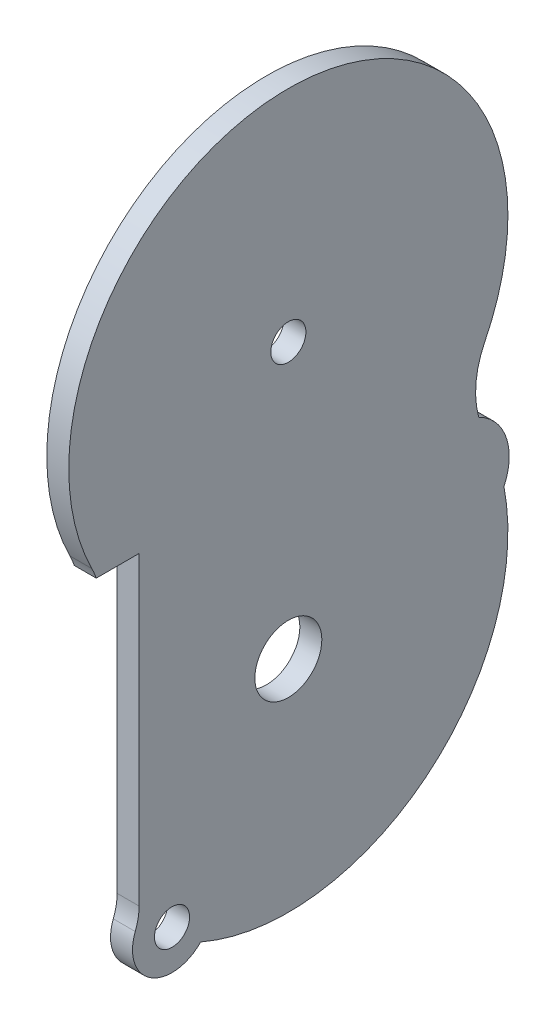
ISO-10303-21;
HEADER;
FILE_DESCRIPTION(('STEP AP214'),'2;1');
FILE_NAME('part.step','',(''),(''),'','','');
FILE_SCHEMA(('AUTOMOTIVE_DESIGN { 1 0 10303 214 1 1 1 1 }'));
ENDSEC;
DATA;
#1=APPLICATION_CONTEXT('core data for automotive mechanical design processes');
#2=APPLICATION_PROTOCOL_DEFINITION('international standard','automotive_design',2000,#1);
#3=PRODUCT_CONTEXT('',#1,'mechanical');
#4=PRODUCT('Part','Part','',(#3));
#5=PRODUCT_RELATED_PRODUCT_CATEGORY('part','',(#4));
#6=PRODUCT_DEFINITION_FORMATION('','',#4);
#7=PRODUCT_DEFINITION_CONTEXT('part definition',#1,'design');
#8=PRODUCT_DEFINITION('design','',#6,#7);
#9=PRODUCT_DEFINITION_SHAPE('','',#8);
#10=(LENGTH_UNIT() NAMED_UNIT(*) SI_UNIT(.MILLI.,.METRE.));
#11=(NAMED_UNIT(*) PLANE_ANGLE_UNIT() SI_UNIT($,.RADIAN.));
#12=(NAMED_UNIT(*) SI_UNIT($,.STERADIAN.) SOLID_ANGLE_UNIT());
#13=UNCERTAINTY_MEASURE_WITH_UNIT(LENGTH_MEASURE(1.E-05),#10,'distance_accuracy_value','');
#14=(GEOMETRIC_REPRESENTATION_CONTEXT(3) GLOBAL_UNCERTAINTY_ASSIGNED_CONTEXT((#13)) GLOBAL_UNIT_ASSIGNED_CONTEXT((#10,
#11,#12)) REPRESENTATION_CONTEXT('',''));
#15=CARTESIAN_POINT('',(0.,0.,0.));
#16=DIRECTION('',(0.,0.,1.));
#17=DIRECTION('',(1.,0.,0.));
#18=AXIS2_PLACEMENT_3D('',#15,#16,#17);
#19=CARTESIAN_POINT('',(-2.93378069120176,0.,-8.31641879275313));
#20=DIRECTION('',(0.,0.,-1.));
#21=DIRECTION('',(-1.,0.,0.));
#22=AXIS2_PLACEMENT_3D('',#19,#20,#21);
#23=PLANE('',#22);
#24=DIRECTION('',(0.,-1.,0.));
#25=VECTOR('',#24,1.);
#26=CARTESIAN_POINT('',(-4.93378069120176,0.,-8.31641879275313));
#27=LINE('',#26,#25);
#28=CARTESIAN_POINT('',(-4.93378069120176,-3.5830057275672,-8.31641879275313));
#29=VERTEX_POINT('',#28);
#30=CARTESIAN_POINT('',(-4.93378069120176,-31.3949801182929,-8.31641879275317));
#31=VERTEX_POINT('',#30);
#32=EDGE_CURVE('E154',#29,#31,#27,.T.);
#33=ORIENTED_EDGE('',*,*,#32,.T.);
#34=DIRECTION('',(-1.,0.,0.));
#35=VECTOR('',#34,1.);
#36=CARTESIAN_POINT('',(-2.93378069120176,-31.3949801182929,-8.31641879275317));
#37=LINE('',#36,#35);
#38=CARTESIAN_POINT('',(-2.93378069120176,-31.3949801182929,-8.31641879275317));
#39=VERTEX_POINT('',#38);
#40=EDGE_CURVE('E11',#39,#31,#37,.T.);
#41=ORIENTED_EDGE('',*,*,#40,.F.);
#42=DIRECTION('',(0.,-1.,0.));
#43=VECTOR('',#42,1.);
#44=CARTESIAN_POINT('',(-2.93378069120176,0.,-8.31641879275313));
#45=LINE('',#44,#43);
#46=CARTESIAN_POINT('',(-2.93378069120176,-3.5830057275672,-8.31641879275313));
#47=VERTEX_POINT('',#46);
#48=EDGE_CURVE('E217',#47,#39,#45,.T.);
#49=ORIENTED_EDGE('',*,*,#48,.F.);
#50=DIRECTION('',(-1.,0.,0.));
#51=VECTOR('',#50,1.);
#52=CARTESIAN_POINT('',(-2.93378069120176,-3.5830057275672,-8.31641879275313));
#53=LINE('',#52,#51);
#54=EDGE_CURVE('E150',#47,#29,#53,.T.);
#55=ORIENTED_EDGE('',*,*,#54,.T.);
#56=EDGE_LOOP('',(#33,#41,#49,#55));
#57=FACE_BOUND('',#56,.T.);
#58=ADVANCED_FACE('F41',(#57),#23,.F.);
#59=CARTESIAN_POINT('',(-2.93378069120176,-31.3949801182929,-3.31641879275324));
#60=DIRECTION('',(-1.,0.,0.));
#61=DIRECTION('',(0.,0.,1.));
#62=AXIS2_PLACEMENT_3D('',#59,#60,#61);
#63=CYLINDRICAL_SURFACE('',#62,4.99999999999993);
#64=CARTESIAN_POINT('',(-4.93378069120176,-31.3949801182929,-3.31641879275324));
#65=DIRECTION('',(1.,0.,0.));
#66=DIRECTION('',(0.,0.,-1.));
#67=AXIS2_PLACEMENT_3D('',#64,#65,#66);
#68=CIRCLE('',#67,4.99999999999993);
#69=CARTESIAN_POINT('',(-4.93378069120176,-33.22983289016,-7.9675815834509));
#70=VERTEX_POINT('',#69);
#71=EDGE_CURVE('E157',#31,#70,#68,.F.);
#72=ORIENTED_EDGE('',*,*,#71,.T.);
#73=DIRECTION('',(-1.,0.,0.));
#74=VECTOR('',#73,1.);
#75=CARTESIAN_POINT('',(-2.93378069120176,-33.22983289016,-7.9675815834509));
#76=LINE('',#75,#74);
#77=CARTESIAN_POINT('',(-2.93378069120176,-33.22983289016,-7.9675815834509));
#78=VERTEX_POINT('',#77);
#79=EDGE_CURVE('E50',#78,#70,#76,.T.);
#80=ORIENTED_EDGE('',*,*,#79,.F.);
#81=CARTESIAN_POINT('',(-2.93378069120176,-31.3949801182929,-3.31641879275324));
#82=DIRECTION('',(1.,0.,0.));
#83=DIRECTION('',(0.,0.,-1.));
#84=AXIS2_PLACEMENT_3D('',#81,#82,#83);
#85=CIRCLE('',#84,4.99999999999993);
#86=EDGE_CURVE('E104',#39,#78,#85,.F.);
#87=ORIENTED_EDGE('',*,*,#86,.F.);
#88=ORIENTED_EDGE('',*,*,#40,.T.);
#89=EDGE_LOOP('',(#72,#80,#87,#88));
#90=FACE_BOUND('',#89,.T.);
#91=ADVANCED_FACE('F236',(#90),#63,.F.);
#92=CARTESIAN_POINT('',(-2.93378069120176,-34.5509268859048,-11.3164187927532));
#93=DIRECTION('',(-1.,0.,0.));
#94=DIRECTION('',(0.,0.,1.));
#95=AXIS2_PLACEMENT_3D('',#92,#93,#94);
#96=CYLINDRICAL_SURFACE('',#95,3.6000000000001);
#97=CARTESIAN_POINT('',(-4.93378069120176,-34.5509268859048,-11.3164187927532));
#98=DIRECTION('',(1.,0.,0.));
#99=DIRECTION('',(0.,0.,-1.));
#100=AXIS2_PLACEMENT_3D('',#97,#98,#99);
#101=CIRCLE('',#100,3.6000000000001);
#102=CARTESIAN_POINT('',(-4.93378069120176,-37.0335515650304,-13.9234429013103));
#103=VERTEX_POINT('',#102);
#104=EDGE_CURVE('E159',#70,#103,#101,.T.);
#105=ORIENTED_EDGE('',*,*,#104,.T.);
#106=DIRECTION('',(-1.,0.,0.));
#107=VECTOR('',#106,1.);
#108=CARTESIAN_POINT('',(-2.93378069120176,-37.0335515650304,-13.9234429013103));
#109=LINE('',#108,#107);
#110=CARTESIAN_POINT('',(-2.93378069120176,-37.0335515650304,-13.9234429013103));
#111=VERTEX_POINT('',#110);
#112=EDGE_CURVE('E186',#111,#103,#109,.T.);
#113=ORIENTED_EDGE('',*,*,#112,.F.);
#114=CARTESIAN_POINT('',(-2.93378069120176,-34.5509268859048,-11.3164187927532));
#115=DIRECTION('',(1.,0.,0.));
#116=DIRECTION('',(0.,0.,-1.));
#117=AXIS2_PLACEMENT_3D('',#114,#115,#116);
#118=CIRCLE('',#117,3.6000000000001);
#119=EDGE_CURVE('E194',#78,#111,#118,.T.);
#120=ORIENTED_EDGE('',*,*,#119,.F.);
#121=ORIENTED_EDGE('',*,*,#79,.T.);
#122=EDGE_LOOP('',(#105,#113,#120,#121));
#123=FACE_BOUND('',#122,.T.);
#124=ADVANCED_FACE('F192',(#123),#96,.T.);
#125=CARTESIAN_POINT('',(-2.93378069120176,-18.698005727567,-21.9114187927536));
#126=DIRECTION('',(-1.,0.,0.));
#127=DIRECTION('',(0.,0.,1.));
#128=AXIS2_PLACEMENT_3D('',#125,#126,#127);
#129=CYLINDRICAL_SURFACE('',#128,20.);
#130=CARTESIAN_POINT('',(-4.93378069120176,-18.698005727567,-21.9114187927536));
#131=DIRECTION('',(1.,0.,0.));
#132=DIRECTION('',(0.,0.,-1.));
#133=AXIS2_PLACEMENT_3D('',#130,#131,#132);
#134=CIRCLE('',#133,20.);
#135=CARTESIAN_POINT('',(-4.93378069120176,-14.9205868842048,-41.5514571552878));
#136=VERTEX_POINT('',#135);
#137=EDGE_CURVE('E161',#103,#136,#134,.T.);
#138=ORIENTED_EDGE('',*,*,#137,.T.);
#139=DIRECTION('',(-1.,0.,0.));
#140=VECTOR('',#139,1.);
#141=CARTESIAN_POINT('',(-2.93378069120176,-14.9205868842048,-41.5514571552878));
#142=LINE('',#141,#140);
#143=CARTESIAN_POINT('',(-2.93378069120176,-14.9205868842048,-41.5514571552878));
#144=VERTEX_POINT('',#143);
#145=EDGE_CURVE('E183',#144,#136,#142,.T.);
#146=ORIENTED_EDGE('',*,*,#145,.F.);
#147=CARTESIAN_POINT('',(-2.93378069120176,-18.698005727567,-21.9114187927536));
#148=DIRECTION('',(1.,0.,0.));
#149=DIRECTION('',(0.,0.,-1.));
#150=AXIS2_PLACEMENT_3D('',#147,#148,#149);
#151=CIRCLE('',#150,20.);
#152=EDGE_CURVE('E211',#111,#144,#151,.T.);
#153=ORIENTED_EDGE('',*,*,#152,.F.);
#154=ORIENTED_EDGE('',*,*,#112,.T.);
#155=EDGE_LOOP('',(#138,#146,#153,#154));
#156=FACE_BOUND('',#155,.T.);
#157=ADVANCED_FACE('F204',(#156),#129,.T.);
#158=CARTESIAN_POINT('',(-2.93378069120176,-12.7830057275671,-37.0314187927532));
#159=DIRECTION('',(-1.,0.,0.));
#160=DIRECTION('',(0.,0.,1.));
#161=AXIS2_PLACEMENT_3D('',#158,#159,#160);
#162=CYLINDRICAL_SURFACE('',#161,4.99999999999971);
#163=CARTESIAN_POINT('',(-4.93378069120176,-12.7830057275671,-37.0314187927532));
#164=DIRECTION('',(1.,0.,0.));
#165=DIRECTION('',(0.,0.,-1.));
#166=AXIS2_PLACEMENT_3D('',#163,#164,#165);
#167=CIRCLE('',#166,4.99999999999971);
#168=CARTESIAN_POINT('',(-4.93378069120176,-8.30104590636624,-39.2477301790738));
#169=VERTEX_POINT('',#168);
#170=EDGE_CURVE('E163',#136,#169,#167,.T.);
#171=ORIENTED_EDGE('',*,*,#170,.T.);
#172=DIRECTION('',(-1.,0.,0.));
#173=VECTOR('',#172,1.);
#174=CARTESIAN_POINT('',(-2.93378069120176,-8.30104590636624,-39.2477301790738));
#175=LINE('',#174,#173);
#176=CARTESIAN_POINT('',(-2.93378069120176,-8.30104590636624,-39.2477301790738));
#177=VERTEX_POINT('',#176);
#178=EDGE_CURVE('E180',#177,#169,#175,.T.);
#179=ORIENTED_EDGE('',*,*,#178,.F.);
#180=CARTESIAN_POINT('',(-2.93378069120176,-12.7830057275671,-37.0314187927532));
#181=DIRECTION('',(1.,0.,0.));
#182=DIRECTION('',(0.,0.,-1.));
#183=AXIS2_PLACEMENT_3D('',#180,#181,#182);
#184=CIRCLE('',#183,4.99999999999971);
#185=EDGE_CURVE('E210',#144,#177,#184,.T.);
#186=ORIENTED_EDGE('',*,*,#185,.F.);
#187=ORIENTED_EDGE('',*,*,#145,.T.);
#188=EDGE_LOOP('',(#171,#179,#186,#187));
#189=FACE_BOUND('',#188,.T.);
#190=ADVANCED_FACE('F208',(#189),#162,.T.);
#191=CARTESIAN_POINT('',(-2.93378069120176,-6.19800572756679,-46.9663584254887));
#192=DIRECTION('',(-1.,0.,0.));
#193=DIRECTION('',(0.,0.,1.));
#194=AXIS2_PLACEMENT_3D('',#191,#192,#193);
#195=CYLINDRICAL_SURFACE('',#194,7.9999999999999);
#196=CARTESIAN_POINT('',(-4.93378069120176,-6.19800572756679,-46.9663584254887));
#197=DIRECTION('',(1.,0.,0.));
#198=DIRECTION('',(0.,0.,-1.));
#199=AXIS2_PLACEMENT_3D('',#196,#197,#198);
#200=CIRCLE('',#199,7.9999999999999);
#201=CARTESIAN_POINT('',(-4.93378069120176,-2.62657715613827,-39.8078042447071));
#202=VERTEX_POINT('',#201);
#203=EDGE_CURVE('E165',#169,#202,#200,.F.);
#204=ORIENTED_EDGE('',*,*,#203,.T.);
#205=DIRECTION('',(-1.,0.,0.));
#206=VECTOR('',#205,1.);
#207=CARTESIAN_POINT('',(-2.93378069120176,-2.62657715613827,-39.8078042447071));
#208=LINE('',#207,#206);
#209=CARTESIAN_POINT('',(-2.93378069120176,-2.62657715613827,-39.8078042447071));
#210=VERTEX_POINT('',#209);
#211=EDGE_CURVE('E136',#210,#202,#208,.T.);
#212=ORIENTED_EDGE('',*,*,#211,.F.);
#213=CARTESIAN_POINT('',(-2.93378069120176,-6.19800572756679,-46.9663584254887));
#214=DIRECTION('',(1.,0.,0.));
#215=DIRECTION('',(0.,0.,-1.));
#216=AXIS2_PLACEMENT_3D('',#213,#214,#215);
#217=CIRCLE('',#216,7.9999999999999);
#218=EDGE_CURVE('E127',#177,#210,#217,.F.);
#219=ORIENTED_EDGE('',*,*,#218,.F.);
#220=ORIENTED_EDGE('',*,*,#178,.T.);
#221=EDGE_LOOP('',(#204,#212,#219,#220));
#222=FACE_BOUND('',#221,.T.);
#223=ADVANCED_FACE('F249',(#222),#195,.F.);
#224=CARTESIAN_POINT('',(-2.93378069120176,6.30199427243294,-21.9114187927536));
#225=DIRECTION('',(-1.,0.,0.));
#226=DIRECTION('',(0.,0.,1.));
#227=AXIS2_PLACEMENT_3D('',#224,#225,#226);
#228=CYLINDRICAL_SURFACE('',#227,19.9999999999997);
#229=CARTESIAN_POINT('',(-4.93378069120176,6.30199427243294,-21.9114187927536));
#230=DIRECTION('',(1.,0.,0.));
#231=DIRECTION('',(0.,0.,-1.));
#232=AXIS2_PLACEMENT_3D('',#229,#230,#231);
#233=CIRCLE('',#232,19.9999999999997);
#234=CARTESIAN_POINT('',(-4.93378069120176,-2.62657715613863,-4.01503334080031));
#235=VERTEX_POINT('',#234);
#236=EDGE_CURVE('E135',#202,#235,#233,.T.);
#237=ORIENTED_EDGE('',*,*,#236,.T.);
#238=DIRECTION('',(-1.,0.,0.));
#239=VECTOR('',#238,1.);
#240=CARTESIAN_POINT('',(-2.93378069120176,-2.62657715613863,-4.01503334080031));
#241=LINE('',#240,#239);
#242=CARTESIAN_POINT('',(-2.93378069120176,-2.62657715613863,-4.01503334080031));
#243=VERTEX_POINT('',#242);
#244=EDGE_CURVE('E132',#243,#235,#241,.T.);
#245=ORIENTED_EDGE('',*,*,#244,.F.);
#246=CARTESIAN_POINT('',(-2.93378069120176,6.30199427243294,-21.9114187927536));
#247=DIRECTION('',(1.,0.,0.));
#248=DIRECTION('',(0.,0.,-1.));
#249=AXIS2_PLACEMENT_3D('',#246,#247,#248);
#250=CIRCLE('',#249,19.9999999999997);
#251=EDGE_CURVE('E120',#210,#243,#250,.T.);
#252=ORIENTED_EDGE('',*,*,#251,.F.);
#253=ORIENTED_EDGE('',*,*,#211,.T.);
#254=EDGE_LOOP('',(#237,#245,#252,#253));
#255=FACE_BOUND('',#254,.T.);
#256=ADVANCED_FACE('F133',(#255),#228,.T.);
#257=CARTESIAN_POINT('',(-2.93378069120176,-6.19800572756679,3.14352083998148));
#258=DIRECTION('',(-1.,0.,0.));
#259=DIRECTION('',(0.,0.,1.));
#260=AXIS2_PLACEMENT_3D('',#257,#258,#259);
#261=CYLINDRICAL_SURFACE('',#260,8.00000000000012);
#262=CARTESIAN_POINT('',(-4.93378069120176,-6.19800572756679,3.14352083998148));
#263=DIRECTION('',(1.,0.,0.));
#264=DIRECTION('',(0.,0.,-1.));
#265=AXIS2_PLACEMENT_3D('',#262,#263,#264);
#266=CIRCLE('',#265,8.00000000000012);
#267=CARTESIAN_POINT('',(-4.93378069120176,-3.5830057275672,-4.41701981528908));
#268=VERTEX_POINT('',#267);
#269=EDGE_CURVE('E90',#235,#268,#266,.F.);
#270=ORIENTED_EDGE('',*,*,#269,.T.);
#271=DIRECTION('',(-1.,0.,0.));
#272=VECTOR('',#271,1.);
#273=CARTESIAN_POINT('',(-2.93378069120176,-3.5830057275672,-4.41701981528908));
#274=LINE('',#273,#272);
#275=CARTESIAN_POINT('',(-2.93378069120176,-3.5830057275672,-4.41701981528908));
#276=VERTEX_POINT('',#275);
#277=EDGE_CURVE('E137',#276,#268,#274,.T.);
#278=ORIENTED_EDGE('',*,*,#277,.F.);
#279=CARTESIAN_POINT('',(-2.93378069120176,-6.19800572756679,3.14352083998148));
#280=DIRECTION('',(1.,0.,0.));
#281=DIRECTION('',(0.,0.,-1.));
#282=AXIS2_PLACEMENT_3D('',#279,#280,#281);
#283=CIRCLE('',#282,8.00000000000012);
#284=EDGE_CURVE('E125',#243,#276,#283,.F.);
#285=ORIENTED_EDGE('',*,*,#284,.F.);
#286=ORIENTED_EDGE('',*,*,#244,.T.);
#287=EDGE_LOOP('',(#270,#278,#285,#286));
#288=FACE_BOUND('',#287,.T.);
#289=ADVANCED_FACE('F139',(#288),#261,.F.);
#290=CARTESIAN_POINT('',(-2.93378069120176,-18.698005727567,-21.9114187927536));
#291=DIRECTION('',(-1.,0.,0.));
#292=DIRECTION('',(0.,0.,1.));
#293=AXIS2_PLACEMENT_3D('',#290,#291,#292);
#294=CYLINDRICAL_SURFACE('',#293,3.05000000000042);
#295=CARTESIAN_POINT('',(-2.93378069120176,-18.698005727567,-21.9114187927536));
#296=DIRECTION('',(1.,0.,0.));
#297=DIRECTION('',(0.,0.,-1.));
#298=AXIS2_PLACEMENT_3D('',#295,#296,#297);
#299=CIRCLE('',#298,3.05000000000042);
#300=CARTESIAN_POINT('',(-2.93378069120176,-18.698005727567,-24.961418792754));
#301=VERTEX_POINT('',#300);
#302=EDGE_CURVE('E141',#301,#301,#299,.T.);
#303=ORIENTED_EDGE('',*,*,#302,.T.);
#304=EDGE_LOOP('',(#303));
#305=FACE_BOUND('',#304,.T.);
#306=CARTESIAN_POINT('',(-4.93378069120176,-18.698005727567,-21.9114187927536));
#307=DIRECTION('',(1.,0.,0.));
#308=DIRECTION('',(0.,0.,-1.));
#309=AXIS2_PLACEMENT_3D('',#306,#307,#308);
#310=CIRCLE('',#309,3.05000000000042);
#311=CARTESIAN_POINT('',(-4.93378069120176,-18.698005727567,-24.961418792754));
#312=VERTEX_POINT('',#311);
#313=EDGE_CURVE('E170',#312,#312,#310,.T.);
#314=ORIENTED_EDGE('',*,*,#313,.F.);
#315=EDGE_LOOP('',(#314));
#316=FACE_BOUND('',#315,.T.);
#317=ADVANCED_FACE('F257',(#305,#316),#294,.F.);
#318=CARTESIAN_POINT('',(-2.93378069120176,-3.58300572756692,1.20328977749549E-13));
#319=DIRECTION('',(0.,1.,0.));
#320=DIRECTION('',(0.,0.,1.));
#321=AXIS2_PLACEMENT_3D('',#318,#319,#320);
#322=PLANE('',#321);
#323=DIRECTION('',(0.,0.,-1.));
#324=VECTOR('',#323,1.);
#325=CARTESIAN_POINT('',(-4.93378069120176,-3.58300572756692,1.20328977749549E-13));
#326=LINE('',#325,#324);
#327=EDGE_CURVE('E96',#268,#29,#326,.T.);
#328=ORIENTED_EDGE('',*,*,#327,.T.);
#329=ORIENTED_EDGE('',*,*,#54,.F.);
#330=DIRECTION('',(0.,0.,-1.));
#331=VECTOR('',#330,1.);
#332=CARTESIAN_POINT('',(-2.93378069120176,-3.58300572756692,1.20328977749549E-13));
#333=LINE('',#332,#331);
#334=EDGE_CURVE('E58',#276,#47,#333,.T.);
#335=ORIENTED_EDGE('',*,*,#334,.F.);
#336=ORIENTED_EDGE('',*,*,#277,.T.);
#337=EDGE_LOOP('',(#328,#329,#335,#336));
#338=FACE_BOUND('',#337,.T.);
#339=ADVANCED_FACE('F258',(#338),#322,.F.);
#340=CARTESIAN_POINT('',(-2.93378069120176,-34.5509268859048,-11.3164187927532));
#341=DIRECTION('',(-1.,0.,0.));
#342=DIRECTION('',(0.,0.,1.));
#343=AXIS2_PLACEMENT_3D('',#340,#341,#342);
#344=CYLINDRICAL_SURFACE('',#343,1.59999999999964);
#345=CARTESIAN_POINT('',(-2.93378069120176,-34.5509268859048,-11.3164187927532));
#346=DIRECTION('',(1.,0.,0.));
#347=DIRECTION('',(0.,0.,-1.));
#348=AXIS2_PLACEMENT_3D('',#345,#346,#347);
#349=CIRCLE('',#348,1.59999999999964);
#350=CARTESIAN_POINT('',(-2.93378069120176,-34.5509268859048,-12.9164187927529));
#351=VERTEX_POINT('',#350);
#352=EDGE_CURVE('E176',#351,#351,#349,.T.);
#353=ORIENTED_EDGE('',*,*,#352,.T.);
#354=EDGE_LOOP('',(#353));
#355=FACE_BOUND('',#354,.T.);
#356=CARTESIAN_POINT('',(-4.93378069120176,-34.5509268859048,-11.3164187927532));
#357=DIRECTION('',(1.,0.,0.));
#358=DIRECTION('',(0.,0.,-1.));
#359=AXIS2_PLACEMENT_3D('',#356,#357,#358);
#360=CIRCLE('',#359,1.59999999999964);
#361=CARTESIAN_POINT('',(-4.93378069120176,-34.5509268859048,-12.9164187927529));
#362=VERTEX_POINT('',#361);
#363=EDGE_CURVE('E151',#362,#362,#360,.T.);
#364=ORIENTED_EDGE('',*,*,#363,.F.);
#365=EDGE_LOOP('',(#364));
#366=FACE_BOUND('',#365,.T.);
#367=ADVANCED_FACE('F43',(#355,#366),#344,.F.);
#368=CARTESIAN_POINT('',(-2.93378069120176,6.30199427243294,-21.9114187927536));
#369=DIRECTION('',(-1.,0.,0.));
#370=DIRECTION('',(0.,0.,1.));
#371=AXIS2_PLACEMENT_3D('',#368,#369,#370);
#372=CYLINDRICAL_SURFACE('',#371,1.59999999999982);
#373=CARTESIAN_POINT('',(-2.93378069120176,6.30199427243294,-21.9114187927536));
#374=DIRECTION('',(1.,0.,0.));
#375=DIRECTION('',(0.,0.,-1.));
#376=AXIS2_PLACEMENT_3D('',#373,#374,#375);
#377=CIRCLE('',#376,1.59999999999982);
#378=CARTESIAN_POINT('',(-2.93378069120176,6.30199427243294,-23.5114187927534));
#379=VERTEX_POINT('',#378);
#380=EDGE_CURVE('E147',#379,#379,#377,.T.);
#381=ORIENTED_EDGE('',*,*,#380,.T.);
#382=EDGE_LOOP('',(#381));
#383=FACE_BOUND('',#382,.T.);
#384=CARTESIAN_POINT('',(-4.93378069120176,6.30199427243294,-21.9114187927536));
#385=DIRECTION('',(1.,0.,0.));
#386=DIRECTION('',(0.,0.,-1.));
#387=AXIS2_PLACEMENT_3D('',#384,#385,#386);
#388=CIRCLE('',#387,1.59999999999982);
#389=CARTESIAN_POINT('',(-4.93378069120176,6.30199427243294,-23.5114187927534));
#390=VERTEX_POINT('',#389);
#391=EDGE_CURVE('E173',#390,#390,#388,.T.);
#392=ORIENTED_EDGE('',*,*,#391,.F.);
#393=EDGE_LOOP('',(#392));
#394=FACE_BOUND('',#393,.T.);
#395=ADVANCED_FACE('F225',(#383,#394),#372,.F.);
#396=CARTESIAN_POINT('',(-2.93378069120176,0.,0.));
#397=DIRECTION('',(1.,0.,0.));
#398=DIRECTION('',(0.,0.,-1.));
#399=AXIS2_PLACEMENT_3D('',#396,#397,#398);
#400=PLANE('',#399);
#401=ORIENTED_EDGE('',*,*,#352,.F.);
#402=EDGE_LOOP('',(#401));
#403=FACE_BOUND('',#402,.T.);
#404=ORIENTED_EDGE('',*,*,#48,.T.);
#405=ORIENTED_EDGE('',*,*,#86,.T.);
#406=ORIENTED_EDGE('',*,*,#119,.T.);
#407=ORIENTED_EDGE('',*,*,#152,.T.);
#408=ORIENTED_EDGE('',*,*,#185,.T.);
#409=ORIENTED_EDGE('',*,*,#218,.T.);
#410=ORIENTED_EDGE('',*,*,#251,.T.);
#411=ORIENTED_EDGE('',*,*,#284,.T.);
#412=ORIENTED_EDGE('',*,*,#334,.T.);
#413=EDGE_LOOP('',(#404,#405,#406,#407,#408,#409,#410,#411,#412));
#414=FACE_BOUND('',#413,.T.);
#415=ORIENTED_EDGE('',*,*,#302,.F.);
#416=EDGE_LOOP('',(#415));
#417=FACE_BOUND('',#416,.T.);
#418=ORIENTED_EDGE('',*,*,#380,.F.);
#419=EDGE_LOOP('',(#418));
#420=FACE_BOUND('',#419,.T.);
#421=ADVANCED_FACE('F122',(#403,#414,#417,#420),#400,.T.);
#422=CARTESIAN_POINT('',(-4.93378069120176,0.,0.));
#423=DIRECTION('',(1.,0.,0.));
#424=DIRECTION('',(0.,0.,-1.));
#425=AXIS2_PLACEMENT_3D('',#422,#423,#424);
#426=PLANE('',#425);
#427=ORIENTED_EDGE('',*,*,#363,.T.);
#428=EDGE_LOOP('',(#427));
#429=FACE_BOUND('',#428,.T.);
#430=ORIENTED_EDGE('',*,*,#32,.F.);
#431=ORIENTED_EDGE('',*,*,#327,.F.);
#432=ORIENTED_EDGE('',*,*,#269,.F.);
#433=ORIENTED_EDGE('',*,*,#236,.F.);
#434=ORIENTED_EDGE('',*,*,#203,.F.);
#435=ORIENTED_EDGE('',*,*,#170,.F.);
#436=ORIENTED_EDGE('',*,*,#137,.F.);
#437=ORIENTED_EDGE('',*,*,#104,.F.);
#438=ORIENTED_EDGE('',*,*,#71,.F.);
#439=EDGE_LOOP('',(#430,#431,#432,#433,#434,#435,#436,#437,#438));
#440=FACE_BOUND('',#439,.T.);
#441=ORIENTED_EDGE('',*,*,#313,.T.);
#442=EDGE_LOOP('',(#441));
#443=FACE_BOUND('',#442,.T.);
#444=ORIENTED_EDGE('',*,*,#391,.T.);
#445=EDGE_LOOP('',(#444));
#446=FACE_BOUND('',#445,.T.);
#447=ADVANCED_FACE('F198',(#429,#440,#443,#446),#426,.F.);
#448=CLOSED_SHELL('',(#58,#91,#124,#157,#190,#223,#256,#289,#317,#339,#367,#395,#421,#447));
#449=MANIFOLD_SOLID_BREP('B2',#448);
#450=ADVANCED_BREP_SHAPE_REPRESENTATION('',(#18,#449),#14);
#451=SHAPE_DEFINITION_REPRESENTATION(#9,#450);
ENDSEC;
END-ISO-10303-21;
